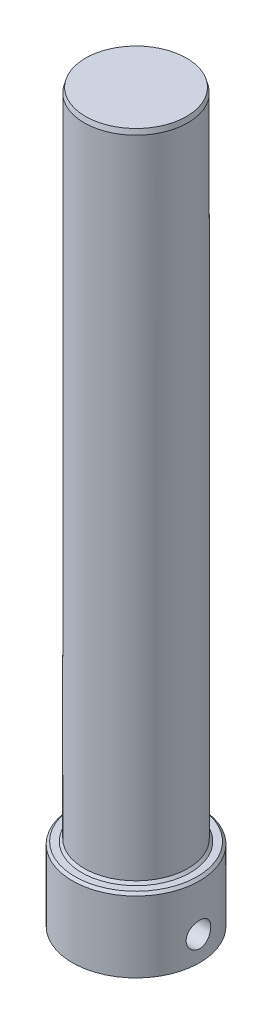
ISO-10303-21;
HEADER;
FILE_DESCRIPTION(('STEP AP214'),'2;1');
FILE_NAME('part.step','',(''),(''),'','','');
FILE_SCHEMA(('AUTOMOTIVE_DESIGN { 1 0 10303 214 1 1 1 1 }'));
ENDSEC;
DATA;
#1=APPLICATION_CONTEXT('core data for automotive mechanical design processes');
#2=APPLICATION_PROTOCOL_DEFINITION('international standard','automotive_design',2000,#1);
#3=PRODUCT_CONTEXT('',#1,'mechanical');
#4=PRODUCT('Part','Part','',(#3));
#5=PRODUCT_RELATED_PRODUCT_CATEGORY('part','',(#4));
#6=PRODUCT_DEFINITION_FORMATION('','',#4);
#7=PRODUCT_DEFINITION_CONTEXT('part definition',#1,'design');
#8=PRODUCT_DEFINITION('design','',#6,#7);
#9=PRODUCT_DEFINITION_SHAPE('','',#8);
#10=(LENGTH_UNIT() NAMED_UNIT(*) SI_UNIT(.MILLI.,.METRE.));
#11=(NAMED_UNIT(*) PLANE_ANGLE_UNIT() SI_UNIT($,.RADIAN.));
#12=(NAMED_UNIT(*) SI_UNIT($,.STERADIAN.) SOLID_ANGLE_UNIT());
#13=UNCERTAINTY_MEASURE_WITH_UNIT(LENGTH_MEASURE(1.E-05),#10,'distance_accuracy_value','');
#14=(GEOMETRIC_REPRESENTATION_CONTEXT(3) GLOBAL_UNCERTAINTY_ASSIGNED_CONTEXT((#13)) GLOBAL_UNIT_ASSIGNED_CONTEXT((#10,
#11,#12)) REPRESENTATION_CONTEXT('',''));
#15=CARTESIAN_POINT('',(0.,0.,0.));
#16=DIRECTION('',(0.,0.,1.));
#17=DIRECTION('',(1.,0.,0.));
#18=AXIS2_PLACEMENT_3D('',#15,#16,#17);
#19=CARTESIAN_POINT('',(0.,-19.05,0.));
#20=DIRECTION('',(0.,1.,0.));
#21=DIRECTION('',(0.,0.,1.));
#22=AXIS2_PLACEMENT_3D('',#19,#20,#21);
#23=CYLINDRICAL_SURFACE('',#22,16.51);
#24=CARTESIAN_POINT('',(0.,-0.63499999999992,0.));
#25=DIRECTION('',(0.,-1.,0.));
#26=DIRECTION('',(0.,0.,-1.));
#27=AXIS2_PLACEMENT_3D('',#24,#25,#26);
#28=CIRCLE('',#27,16.51);
#29=CARTESIAN_POINT('',(0.,-0.63499999999992,-16.51));
#30=VERTEX_POINT('',#29);
#31=EDGE_CURVE('E163',#30,#30,#28,.T.);
#32=ORIENTED_EDGE('',*,*,#31,.T.);
#33=EDGE_LOOP('',(#32));
#34=FACE_BOUND('',#33,.T.);
#35=CARTESIAN_POINT('',(16.51,-9.47460000000001,0.));
#36=CARTESIAN_POINT('',(16.50999674304,-9.47460667765774,0.17798180768145));
#37=CARTESIAN_POINT('',(16.507092342162,-9.4894971517823,0.356049251389576));
#38=CARTESIAN_POINT('',(16.4957861563419,-9.54862279771489,0.70715860012845));
#39=CARTESIAN_POINT('',(16.4873798679605,-9.59288200901663,0.880196266869084));
#40=CARTESIAN_POINT('',(16.4660094238541,-9.70933273581575,1.21611816234647));
#41=CARTESIAN_POINT('',(16.4530495104819,-9.78149825886547,1.3790116760923));
#42=CARTESIAN_POINT('',(16.4239838486872,-9.95163756771118,1.69036570315343));
#43=CARTESIAN_POINT('',(16.4078783211392,-10.0496095416334,1.83882722873875));
#44=CARTESIAN_POINT('',(16.3740667579311,-10.269906920626,2.11901057407795));
#45=CARTESIAN_POINT('',(16.3563445317891,-10.3924978998598,2.25052165052108));
#46=CARTESIAN_POINT('',(16.3214159486626,-10.6579822857242,2.49124700746998));
#47=CARTESIAN_POINT('',(16.3042096304062,-10.8008772119302,2.60045961763571));
#48=CARTESIAN_POINT('',(16.2721032999058,-11.104415875147,2.79437468505035));
#49=CARTESIAN_POINT('',(16.2572241415051,-11.2652001946592,2.87886084349837));
#50=CARTESIAN_POINT('',(16.2316858498261,-11.599017629918,3.01953958524562));
#51=CARTESIAN_POINT('',(16.2210263262906,-11.7720496111815,3.07573478519324));
#52=CARTESIAN_POINT('',(16.2052976051904,-12.1231893988036,3.15755616933753));
#53=CARTESIAN_POINT('',(16.2001610491341,-12.3012082260996,3.18355100189486));
#54=CARTESIAN_POINT('',(16.195856931735,-12.6591489223222,3.20537841463388));
#55=CARTESIAN_POINT('',(16.1966887977118,-12.8390706070123,3.20121388865741));
#56=CARTESIAN_POINT('',(16.2041662705445,-13.1930257783789,3.16313929064411));
#57=CARTESIAN_POINT('',(16.2107296102793,-13.367106536188,3.12965011355796));
#58=CARTESIAN_POINT('',(16.2288011307392,-13.707131058569,3.03454045432905));
#59=CARTESIAN_POINT('',(16.2403095346437,-13.8730744555108,2.97291870250598));
#60=CARTESIAN_POINT('',(16.2670595298424,-14.1933359669825,2.82288636306409));
#61=CARTESIAN_POINT('',(16.2823244679993,-14.3475731668967,2.73430738856974));
#62=CARTESIAN_POINT('',(16.3148523463308,-14.6391529563783,2.53299398365409));
#63=CARTESIAN_POINT('',(16.3321155026422,-14.776493715027,2.42025693905809));
#64=CARTESIAN_POINT('',(16.3670521266041,-15.0328122718534,2.17156617881324));
#65=CARTESIAN_POINT('',(16.3847276028201,-15.1514411539186,2.03525284352528));
#66=CARTESIAN_POINT('',(16.4182300950425,-15.3642024999627,1.74447813646845));
#67=CARTESIAN_POINT('',(16.4340570900122,-15.4583346851709,1.59001655820277));
#68=CARTESIAN_POINT('',(16.4621146941261,-15.6194885297334,1.26695419915434));
#69=CARTESIAN_POINT('',(16.4743402442977,-15.6864721023976,1.09833395254379));
#70=CARTESIAN_POINT('',(16.4937787411311,-15.7910649286274,0.751944560381681));
#71=CARTESIAN_POINT('',(16.5009922575615,-15.8286775211488,0.574176457227819));
#72=CARTESIAN_POINT('',(16.5095151126487,-15.8729708857586,0.217537640147078));
#73=CARTESIAN_POINT('',(16.5109156402885,-15.880129438696,0.0387283752846515));
#74=CARTESIAN_POINT('',(16.5079073053387,-15.8645956808591,-0.317531685249361));
#75=CARTESIAN_POINT('',(16.5034987486826,-15.8419049420877,-0.494982551965513));
#76=CARTESIAN_POINT('',(16.4894245188852,-15.7677137984373,-0.841960229706106));
#77=CARTESIAN_POINT('',(16.4798032895861,-15.7164568479512,-1.01154105682331));
#78=CARTESIAN_POINT('',(16.4563783011238,-15.5868530220226,-1.33970164288561));
#79=CARTESIAN_POINT('',(16.4425742430368,-15.5085042104173,-1.49828061459286));
#80=CARTESIAN_POINT('',(16.4120874585302,-15.3258951742523,-1.80196304563636));
#81=CARTESIAN_POINT('',(16.3953732217461,-15.2213451526579,-1.94688901633144));
#82=CARTESIAN_POINT('',(16.3609977215536,-14.9896915680213,-2.21731110390962));
#83=CARTESIAN_POINT('',(16.3433363633095,-14.8625857435063,-2.34280527017124));
#84=CARTESIAN_POINT('',(16.3087522057841,-14.5872595216095,-2.57263120454265));
#85=CARTESIAN_POINT('',(16.2918435170704,-14.4387640556155,-2.67663593044607));
#86=CARTESIAN_POINT('',(16.2609705055352,-14.1261296290826,-2.85822623915068));
#87=CARTESIAN_POINT('',(16.2470060688858,-13.9619912736709,-2.93581284337597));
#88=CARTESIAN_POINT('',(16.2237150163488,-13.6235331612705,-3.06190939284739));
#89=CARTESIAN_POINT('',(16.214365203049,-13.4492693554404,-3.11056503053249));
#90=CARTESIAN_POINT('',(16.2013109097146,-13.0948405207693,-3.17786420463009));
#91=CARTESIAN_POINT('',(16.1976057435017,-12.9146762119295,-3.1965113889653));
#92=CARTESIAN_POINT('',(16.1962967155522,-12.5568402333229,-3.20313576197228));
#93=CARTESIAN_POINT('',(16.1985901396438,-12.3791782943722,-3.19162926715146));
#94=CARTESIAN_POINT('',(16.208791254997,-12.028373074834,-3.13940786892188));
#95=CARTESIAN_POINT('',(16.2166989070867,-11.8552297627276,-3.09869316930592));
#96=CARTESIAN_POINT('',(16.237192887046,-11.5186798504674,-2.98943524126549));
#97=CARTESIAN_POINT('',(16.2497691865703,-11.3552532453062,-2.92095163211065));
#98=CARTESIAN_POINT('',(16.2781898190479,-11.0421279714725,-2.75815771372782));
#99=CARTESIAN_POINT('',(16.2940344046183,-10.8924303652541,-2.66384540792653));
#100=CARTESIAN_POINT('',(16.3275228883509,-10.6084337733996,-2.45029202500991));
#101=CARTESIAN_POINT('',(16.3451914963496,-10.4744191298477,-2.33067662058621));
#102=CARTESIAN_POINT('',(16.3801561480506,-10.2281924525785,-2.07068925117976));
#103=CARTESIAN_POINT('',(16.3974521052458,-10.1159854338071,-1.93031252490078));
#104=CARTESIAN_POINT('',(16.4299205179773,-9.91553400946462,-1.63114902096518));
#105=CARTESIAN_POINT('',(16.4450706857495,-9.82753326228692,-1.47219647581962));
#106=CARTESIAN_POINT('',(16.4713220692793,-9.67962902624368,-1.14151510073308));
#107=CARTESIAN_POINT('',(16.4824270095001,-9.61969967727725,-0.969798199328333));
#108=CARTESIAN_POINT('',(16.4971258601764,-9.54152763285113,-0.664695879519594));
#109=CARTESIAN_POINT('',(16.5019259058909,-9.51647358438861,-0.533071267119778));
#110=CARTESIAN_POINT('',(16.5083641553618,-9.48300749448238,-0.267647205535638));
#111=CARTESIAN_POINT('',(16.5100024493346,-9.47459497819507,-0.133847818515401));
#112=CARTESIAN_POINT('',(16.51,-9.47460000000001,0.));
#113=B_SPLINE_CURVE_WITH_KNOTS('',3,(#35,#36,#37,#38,#39,#40,#41,#42,#43,#44,#45,#46,#47,#48,
#49,#50,#51,#52,#53,#54,#55,#56,#57,#58,#59,#60,#61,#62,#63,#64,#65,#66,#67,#68,#69,#70,#71,#72,
#73,#74,#75,#76,#77,#78,#79,#80,#81,#82,#83,#84,#85,#86,#87,#88,#89,#90,#91,#92,#93,#94,#95,#96,
#97,#98,#99,#100,#101,#102,#103,#104,#105,#106,#107,#108,#109,#110,#111,#112),.UNSPECIFIED.,.T.,
.F.,(4,2,2,2,2,2,2,2,2,2,2,2,2,2,2,2,2,2,2,2,2,2,2,2,2,2,2,2,2,2,2,2,2,2,2,2,2,2,4),(0.,
0.533455850880798,1.0673488963789,1.60074585728947,2.1341053783184,2.6735615359542,
3.21305808851611,3.75714183271645,4.30117524502292,4.83849558583837,5.37576437053482,
5.90544588478012,6.43515130699299,6.96823589084945,7.50137818960588,8.04351567034775,
8.58565932030948,9.12856093071924,9.67140081392448,10.2056921560157,10.7399553609571,
11.2697334611978,11.7995494306993,12.3355061477134,12.8715166308032,13.4151651522043,
13.9587926517185,14.4996588071386,15.0404592081862,15.5720603196624,16.1036577220635,
16.6341197886237,17.1646228717903,17.703604584557,18.2427100968776,18.7870586150841,
19.3309046742396,19.7320914038779,20.1332666860308),.UNSPECIFIED.);
#114=CARTESIAN_POINT('',(16.51,-9.47460000000001,0.));
#115=VERTEX_POINT('',#114);
#116=EDGE_CURVE('E98',#115,#115,#113,.T.);
#117=ORIENTED_EDGE('',*,*,#116,.F.);
#118=EDGE_LOOP('',(#117));
#119=FACE_BOUND('',#118,.T.);
#120=CARTESIAN_POINT('',(-16.1968373406662,-12.675,3.20039999999999));
#121=CARTESIAN_POINT('',(-16.1968408370885,-12.4970536068067,3.20039329462291));
#122=CARTESIAN_POINT('',(-16.199801714413,-12.3190215017697,3.18550854520744));
#123=CARTESIAN_POINT('',(-16.2113092396805,-11.9679855332422,3.12640769828341));
#124=CARTESIAN_POINT('',(-16.21986049139,-11.7949859368602,3.08216742556175));
#125=CARTESIAN_POINT('',(-16.2415447141987,-11.4591446598796,2.96577206860551));
#126=CARTESIAN_POINT('',(-16.2546732717614,-11.2962933717222,2.89364386723661));
#127=CARTESIAN_POINT('',(-16.2840276129419,-10.9850105054433,2.72359253019602));
#128=CARTESIAN_POINT('',(-16.3002531893747,-10.8365779637349,2.62567111987785));
#129=CARTESIAN_POINT('',(-16.3342142860278,-10.5563635938619,2.40542553248826));
#130=CARTESIAN_POINT('',(-16.3519654972302,-10.4248012944443,2.28282442927953));
#131=CARTESIAN_POINT('',(-16.3868394064612,-10.1839765897216,2.01729806766049));
#132=CARTESIAN_POINT('',(-16.4039620617819,-10.0747156974195,1.87437143141261));
#133=CARTESIAN_POINT('',(-16.4358182666265,-9.88074875564761,1.57080329941635));
#134=CARTESIAN_POINT('',(-16.4505311646598,-9.79625050942602,1.41002667352363));
#135=CARTESIAN_POINT('',(-16.4757341598397,-9.65554731981939,1.07622588690727));
#136=CARTESIAN_POINT('',(-16.4862246281403,-9.59933988954563,0.903202804227378));
#137=CARTESIAN_POINT('',(-16.5016899316472,-9.51749497684877,0.552097205795982));
#138=CARTESIAN_POINT('',(-16.5067315424367,-9.49148709868731,0.374104021698516));
#139=CARTESIAN_POINT('',(-16.510961469133,-9.46962470032813,0.0162140490808797));
#140=CARTESIAN_POINT('',(-16.5101503162826,-9.47376744342292,-0.163682565188923));
#141=CARTESIAN_POINT('',(-16.5028180736043,-9.51180619047498,-0.517730132558862));
#142=CARTESIAN_POINT('',(-16.4963735392609,-9.54530329521185,-0.691925758559918));
#143=CARTESIAN_POINT('',(-16.4785847412376,-9.64046810456808,-1.03217586389311));
#144=CARTESIAN_POINT('',(-16.4672402900899,-9.70213688702405,-1.19823003146726));
#145=CARTESIAN_POINT('',(-16.4407992608138,-9.85226930171679,-1.51863105430753));
#146=CARTESIAN_POINT('',(-16.4256806729946,-9.9408908008448,-1.67290204628717));
#147=CARTESIAN_POINT('',(-16.3933606898227,-10.1422964437526,-1.96453167009857));
#148=CARTESIAN_POINT('',(-16.3761590687752,-10.2550832068382,-2.10188846603414));
#149=CARTESIAN_POINT('',(-16.3412431595578,-10.5038110368456,-2.35815602648105));
#150=CARTESIAN_POINT('',(-16.3235250892839,-10.6401011532109,-2.47672774070443));
#151=CARTESIAN_POINT('',(-16.2898415529933,-10.9308084319086,-2.68938455735478));
#152=CARTESIAN_POINT('',(-16.2738761162447,-11.0852258968695,-2.78346925089668));
#153=CARTESIAN_POINT('',(-16.2454990234452,-11.4082727356134,-2.94458807043301));
#154=CARTESIAN_POINT('',(-16.2330942220224,-11.5769287234587,-3.0115701209198));
#155=CARTESIAN_POINT('',(-16.2133455966866,-11.9233963098618,-3.11614912524959));
#156=CARTESIAN_POINT('',(-16.2060011565122,-12.1012067907304,-3.15374965731124));
#157=CARTESIAN_POINT('',(-16.1973275168186,-12.457870811803,-3.19799741128217));
#158=CARTESIAN_POINT('',(-16.1959034219589,-12.6366615226937,-3.20513299684504));
#159=CARTESIAN_POINT('',(-16.1989773838334,-12.9928791052729,-3.18955993383087));
#160=CARTESIAN_POINT('',(-16.2034751263229,-13.1703060488277,-3.16685286886616));
#161=CARTESIAN_POINT('',(-16.217797349929,-13.5171361018236,-3.09265921637369));
#162=CARTESIAN_POINT('',(-16.2275739667984,-13.6865966593357,-3.04143110502172));
#163=CARTESIAN_POINT('',(-16.2513107569838,-14.0145293488346,-2.91192485062961));
#164=CARTESIAN_POINT('',(-16.2652712569361,-14.173000621697,-2.833644595553));
#165=CARTESIAN_POINT('',(-16.2960174609597,-14.4766005379119,-2.65114140980347));
#166=CARTESIAN_POINT('',(-16.3128357814171,-14.6215412414279,-2.5466114356931));
#167=CARTESIAN_POINT('',(-16.3473120131875,-14.8920022733975,-2.31498768818158));
#168=CARTESIAN_POINT('',(-16.3649700053153,-15.0175207275762,-2.18789173966978));
#169=CARTESIAN_POINT('',(-16.3994424353559,-15.2474123103623,-1.91255704681583));
#170=CARTESIAN_POINT('',(-16.4162411296968,-15.3514561126571,-1.76404104429389));
#171=CARTESIAN_POINT('',(-16.4468329153043,-15.5331149019244,-1.45135384979494));
#172=CARTESIAN_POINT('',(-16.4606261276923,-15.6107309540107,-1.2871832890827));
#173=CARTESIAN_POINT('',(-16.4835853625841,-15.7368444919255,-0.948734966197626));
#174=CARTESIAN_POINT('',(-16.4927764959996,-15.7855002784596,-0.774517969108592));
#175=CARTESIAN_POINT('',(-16.5056033954493,-15.8528155607709,-0.420188918760878));
#176=CARTESIAN_POINT('',(-16.5092397881807,-15.8714784404217,-0.24007753286152));
#177=CARTESIAN_POINT('',(-16.5105338429712,-15.8781536941807,0.117775704217827));
#178=CARTESIAN_POINT('',(-16.5082883058813,-15.866662321135,0.295508137030864));
#179=CARTESIAN_POINT('',(-16.4982731492246,-15.8144465650402,0.646458375864037));
#180=CARTESIAN_POINT('',(-16.4905035906677,-15.7737225048509,0.819676231723427));
#181=CARTESIAN_POINT('',(-16.4703147317054,-15.6644122848564,1.15639449812764));
#182=CARTESIAN_POINT('',(-16.45790482037,-15.5958823624448,1.31991376346508));
#183=CARTESIAN_POINT('',(-16.4297750496249,-15.4329668042514,1.63320539817821));
#184=CARTESIAN_POINT('',(-16.4140549483119,-15.338579278686,1.78297676173029));
#185=CARTESIAN_POINT('',(-16.3807343282353,-15.1249367322104,2.06698451812295));
#186=CARTESIAN_POINT('',(-16.3631088199613,-15.0053249186914,2.20094961538694));
#187=CARTESIAN_POINT('',(-16.3281169042677,-14.7453659332463,2.44707799498908));
#188=CARTESIAN_POINT('',(-16.3107505589572,-14.6050138760175,2.55923612630815));
#189=CARTESIAN_POINT('',(-16.2780526864317,-14.3058763617694,2.75962697300912));
#190=CARTESIAN_POINT('',(-16.2627432511022,-14.146920559583,2.84760914075398));
#191=CARTESIAN_POINT('',(-16.2361603490368,-13.8162338622295,2.9954777742769));
#192=CARTESIAN_POINT('',(-16.2248831489107,-13.6445149631382,3.05539024543079));
#193=CARTESIAN_POINT('',(-16.209942995461,-13.3394560885758,3.13352096460904));
#194=CARTESIAN_POINT('',(-16.2050581936248,-13.2078796069866,3.15855668056737));
#195=CARTESIAN_POINT('',(-16.198504101096,-12.9425515253264,3.19199846386678));
#196=CARTESIAN_POINT('',(-16.1968347116651,-12.8087999921736,3.20040504185212));
#197=CARTESIAN_POINT('',(-16.1968373406662,-12.675,3.20039999999999));
#198=B_SPLINE_CURVE_WITH_KNOTS('',3,(#120,#121,#122,#123,#124,#125,#126,#127,#128,#129,#130,
#131,#132,#133,#134,#135,#136,#137,#138,#139,#140,#141,#142,#143,#144,#145,#146,#147,#148,#149,
#150,#151,#152,#153,#154,#155,#156,#157,#158,#159,#160,#161,#162,#163,#164,#165,#166,#167,#168,
#169,#170,#171,#172,#173,#174,#175,#176,#177,#178,#179,#180,#181,#182,#183,#184,#185,#186,#187,
#188,#189,#190,#191,#192,#193,#194,#195,#196,#197),.UNSPECIFIED.,.T.,.F.,(4,2,2,2,2,2,2,2,2,2,2,
2,2,2,2,2,2,2,2,2,2,2,2,2,2,2,2,2,2,2,2,2,2,2,2,2,2,2,4),(0.,0.533349407210311,1.06713859076651,
1.60041450027685,2.13365474707011,2.67325021383514,3.21288227642379,3.75692102558969,
4.30091194297104,4.8381579166777,5.37535512632323,5.90536357712515,6.43539230752734,
6.96858733469458,7.5018401848584,8.04382889867185,8.5858266620499,9.12886094014704,
9.67182907468013,10.2060597707925,10.7402621188811,11.2697001853053,11.7991795957807,
12.33516700758,12.8712061107201,13.4149383240578,13.9586486208422,14.499358960155,
15.0400082909156,15.571816095792,16.1036180272185,16.6343497076525,17.165120186566,
17.703973192481,18.2429533265351,18.7873248615241,19.331191057323,19.7322350835932,
20.1332667944918),.UNSPECIFIED.);
#199=CARTESIAN_POINT('',(-16.1968373406662,-12.675,3.20039999999999));
#200=VERTEX_POINT('',#199);
#201=EDGE_CURVE('E121',#200,#200,#198,.T.);
#202=ORIENTED_EDGE('',*,*,#201,.F.);
#203=EDGE_LOOP('',(#202));
#204=FACE_BOUND('',#203,.T.);
#205=CARTESIAN_POINT('',(0.,-19.05,0.));
#206=DIRECTION('',(0.,1.,0.));
#207=DIRECTION('',(0.,0.,-1.));
#208=AXIS2_PLACEMENT_3D('',#205,#206,#207);
#209=CIRCLE('',#208,16.51);
#210=CARTESIAN_POINT('',(0.,-19.05,-16.51));
#211=VERTEX_POINT('',#210);
#212=EDGE_CURVE('E107',#211,#211,#209,.T.);
#213=ORIENTED_EDGE('',*,*,#212,.T.);
#214=EDGE_LOOP('',(#213));
#215=FACE_BOUND('',#214,.T.);
#216=ADVANCED_FACE('F44',(#34,#119,#204,#215),#23,.T.);
#217=CARTESIAN_POINT('',(0.,-19.05,0.));
#218=DIRECTION('',(0.,-1.,0.));
#219=DIRECTION('',(0.,0.,-1.));
#220=AXIS2_PLACEMENT_3D('',#217,#218,#219);
#221=PLANE('',#220);
#222=CARTESIAN_POINT('',(0.,-19.05,0.));
#223=DIRECTION('',(0.,-1.,0.));
#224=DIRECTION('',(0.,0.,-1.));
#225=AXIS2_PLACEMENT_3D('',#222,#223,#224);
#226=CIRCLE('',#225,11.47);
#227=CARTESIAN_POINT('',(0.,-19.05,-11.47));
#228=VERTEX_POINT('',#227);
#229=EDGE_CURVE('E168',#228,#228,#226,.F.);
#230=ORIENTED_EDGE('',*,*,#229,.T.);
#231=EDGE_LOOP('',(#230));
#232=FACE_BOUND('',#231,.T.);
#233=ORIENTED_EDGE('',*,*,#212,.F.);
#234=EDGE_LOOP('',(#233));
#235=FACE_BOUND('',#234,.T.);
#236=ADVANCED_FACE('F114',(#232,#235),#221,.T.);
#237=CARTESIAN_POINT('',(0.,0.,0.));
#238=DIRECTION('',(0.,-1.,0.));
#239=DIRECTION('',(0.,0.,-1.));
#240=AXIS2_PLACEMENT_3D('',#237,#238,#239);
#241=PLANE('',#240);
#242=CARTESIAN_POINT('',(0.,0.,0.));
#243=DIRECTION('',(0.,-1.,0.));
#244=DIRECTION('',(0.,0.,-1.));
#245=AXIS2_PLACEMENT_3D('',#242,#243,#244);
#246=CIRCLE('',#245,14.0970000000002);
#247=CARTESIAN_POINT('',(0.,0.,-14.0970000000002));
#248=VERTEX_POINT('',#247);
#249=EDGE_CURVE('E156',#248,#248,#246,.T.);
#250=ORIENTED_EDGE('',*,*,#249,.T.);
#251=EDGE_LOOP('',(#250));
#252=FACE_BOUND('',#251,.T.);
#253=CARTESIAN_POINT('',(0.,0.,0.));
#254=DIRECTION('',(0.,-1.,0.));
#255=DIRECTION('',(0.,0.,-1.));
#256=AXIS2_PLACEMENT_3D('',#253,#254,#255);
#257=CIRCLE('',#256,15.8750000000001);
#258=CARTESIAN_POINT('',(0.,0.,-15.8750000000001));
#259=VERTEX_POINT('',#258);
#260=EDGE_CURVE('E166',#259,#259,#257,.F.);
#261=ORIENTED_EDGE('',*,*,#260,.T.);
#262=EDGE_LOOP('',(#261));
#263=FACE_BOUND('',#262,.T.);
#264=ADVANCED_FACE('F116',(#252,#263),#241,.F.);
#265=CARTESIAN_POINT('',(0.,169.545,0.));
#266=DIRECTION('',(0.,-1.,0.));
#267=DIRECTION('',(0.,0.,-1.));
#268=AXIS2_PLACEMENT_3D('',#265,#266,#267);
#269=CYLINDRICAL_SURFACE('',#268,13.462);
#270=CARTESIAN_POINT('',(0.,168.274999999999,0.));
#271=DIRECTION('',(0.,1.,0.));
#272=DIRECTION('',(0.,0.,1.));
#273=AXIS2_PLACEMENT_3D('',#270,#271,#272);
#274=CIRCLE('',#273,13.462);
#275=CARTESIAN_POINT('',(0.,168.274999999999,13.462));
#276=VERTEX_POINT('',#275);
#277=EDGE_CURVE('E11',#276,#276,#274,.F.);
#278=ORIENTED_EDGE('',*,*,#277,.T.);
#279=EDGE_LOOP('',(#278));
#280=FACE_BOUND('',#279,.T.);
#281=CARTESIAN_POINT('',(0.,0.635000000000163,0.));
#282=DIRECTION('',(0.,-1.,0.));
#283=DIRECTION('',(0.,0.,-1.));
#284=AXIS2_PLACEMENT_3D('',#281,#282,#283);
#285=CIRCLE('',#284,13.462);
#286=CARTESIAN_POINT('',(0.,0.635000000000163,-13.462));
#287=VERTEX_POINT('',#286);
#288=EDGE_CURVE('E158',#287,#287,#285,.F.);
#289=ORIENTED_EDGE('',*,*,#288,.T.);
#290=EDGE_LOOP('',(#289));
#291=FACE_BOUND('',#290,.T.);
#292=ADVANCED_FACE('F139',(#280,#291),#269,.T.);
#293=CARTESIAN_POINT('',(0.,169.545,0.));
#294=DIRECTION('',(0.,1.,0.));
#295=DIRECTION('',(0.,0.,1.));
#296=AXIS2_PLACEMENT_3D('',#293,#294,#295);
#297=PLANE('',#296);
#298=CARTESIAN_POINT('',(0.,169.545,0.));
#299=DIRECTION('',(0.,1.,0.));
#300=DIRECTION('',(0.,0.,1.));
#301=AXIS2_PLACEMENT_3D('',#298,#299,#300);
#302=CIRCLE('',#301,13.1217045256123);
#303=CARTESIAN_POINT('',(0.,169.545,13.1217045256123));
#304=VERTEX_POINT('',#303);
#305=EDGE_CURVE('E52',#304,#304,#302,.T.);
#306=ORIENTED_EDGE('',*,*,#305,.T.);
#307=EDGE_LOOP('',(#306));
#308=FACE_BOUND('',#307,.T.);
#309=ADVANCED_FACE('F144',(#308),#297,.T.);
#310=CARTESIAN_POINT('',(0.,-3.175,0.));
#311=DIRECTION('',(0.,-1.,0.));
#312=DIRECTION('',(0.,0.,-1.));
#313=AXIS2_PLACEMENT_3D('',#310,#311,#312);
#314=CYLINDRICAL_SURFACE('',#313,10.2);
#315=CARTESIAN_POINT('',(0.,-17.78,0.));
#316=DIRECTION('',(0.,-1.,0.));
#317=DIRECTION('',(0.,0.,-1.));
#318=AXIS2_PLACEMENT_3D('',#315,#316,#317);
#319=CIRCLE('',#318,10.2);
#320=CARTESIAN_POINT('',(0.,-17.78,-10.2));
#321=VERTEX_POINT('',#320);
#322=EDGE_CURVE('E106',#321,#321,#319,.T.);
#323=ORIENTED_EDGE('',*,*,#322,.T.);
#324=EDGE_LOOP('',(#323));
#325=FACE_BOUND('',#324,.T.);
#326=CARTESIAN_POINT('',(9.68490783848767,-12.675,3.2004));
#327=CARTESIAN_POINT('',(9.68490883266821,-12.849950913271,3.20039892586468));
#328=CARTESIAN_POINT('',(9.68970024615615,-13.0249128561156,3.18600568228919));
#329=CARTESIAN_POINT('',(9.70826260883219,-13.3696940483548,3.12897943755107));
#330=CARTESIAN_POINT('',(9.72203592662601,-13.5395119288509,3.08633898730914));
#331=CARTESIAN_POINT('',(9.75685185054427,-13.8689607127044,2.97443085529272));
#332=CARTESIAN_POINT('',(9.77788150623465,-14.0286091682213,2.90521058602798));
#333=CARTESIAN_POINT('',(9.82482255268545,-14.334071875493,2.74226615801979));
#334=CARTESIAN_POINT('',(9.85073481885756,-14.4798836393837,2.64853760397351));
#335=CARTESIAN_POINT('',(9.90552794558571,-14.7585837435566,2.43576090122778));
#336=CARTESIAN_POINT('',(9.93447647898375,-14.8909224013379,2.31601002211239));
#337=CARTESIAN_POINT('',(9.99150477305061,-15.1340074915928,2.05609143344929));
#338=CARTESIAN_POINT('',(10.019584410916,-15.2447508835673,1.91592085376246));
#339=CARTESIAN_POINT('',(10.0724857455209,-15.4439315010366,1.61518760890245));
#340=CARTESIAN_POINT('',(10.0972184778289,-15.531802055986,1.45423260383434));
#341=CARTESIAN_POINT('',(10.1398486180422,-15.6790106232874,1.11892020713111));
#342=CARTESIAN_POINT('',(10.1577476461163,-15.7383553995392,0.944566004035442));
#343=CARTESIAN_POINT('',(10.1842146221586,-15.8249907885733,0.59316040148627));
#344=CARTESIAN_POINT('',(10.1930554955903,-15.8532210284559,0.41636158952249));
#345=CARTESIAN_POINT('',(10.2013742493619,-15.8798037447998,0.0603305452354245));
#346=CARTESIAN_POINT('',(10.2008542748369,-15.87816306649,-0.118901120167261));
#347=CARTESIAN_POINT('',(10.1906996569874,-15.8456673362163,-0.468094715964739));
#348=CARTESIAN_POINT('',(10.1813828548558,-15.8158309987162,-0.63816216906313));
#349=CARTESIAN_POINT('',(10.1550728222334,-15.7294631946049,-0.970741339298227));
#350=CARTESIAN_POINT('',(10.138079089756,-15.672929982302,-1.13325256157432));
#351=CARTESIAN_POINT('',(10.0978992581119,-15.5341222267642,-1.44844933307421));
#352=CARTESIAN_POINT('',(10.0746395797722,-15.4515396853535,-1.60098947839175));
#353=CARTESIAN_POINT('',(10.0243767899007,-15.2632249560292,-1.89036283711826));
#354=CARTESIAN_POINT('',(9.99737272653199,-15.1574868779177,-2.0271920405268));
#355=CARTESIAN_POINT('',(9.94115541542306,-14.9206380655086,-2.28733308393958));
#356=CARTESIAN_POINT('',(9.91189701686771,-14.7886482684628,-2.40983592933876));
#357=CARTESIAN_POINT('',(9.85544600476605,-14.5057263037764,-2.6312105765544));
#358=CARTESIAN_POINT('',(9.82825363893567,-14.3547918704223,-2.73007954772578));
#359=CARTESIAN_POINT('',(9.77878458453371,-14.0359630661853,-2.90233147465284));
#360=CARTESIAN_POINT('',(9.75656720380155,-13.8678956146216,-2.97541236787446));
#361=CARTESIAN_POINT('',(9.72025877566158,-13.5209743975196,-3.09197996599612));
#362=CARTESIAN_POINT('',(9.70616478069803,-13.3421245703991,-3.13547740623075));
#363=CARTESIAN_POINT('',(9.68835391826993,-12.9864714125791,-3.19007754026352));
#364=CARTESIAN_POINT('',(9.68424018022604,-12.8098781729432,-3.20241998238934));
#365=CARTESIAN_POINT('',(9.6857532851716,-12.4571308992551,-3.19784197702619));
#366=CARTESIAN_POINT('',(9.69137860808314,-12.2809768009589,-3.1809260961925));
#367=CARTESIAN_POINT('',(9.71134394884377,-11.9394631951509,-3.11941994648697));
#368=CARTESIAN_POINT('',(9.72542446020728,-11.7739386682264,-3.07565295680354));
#369=CARTESIAN_POINT('',(9.76043808659058,-11.4526019354729,-2.96265482239493));
#370=CARTESIAN_POINT('',(9.78137232516689,-11.2967913270708,-2.89341950232329));
#371=CARTESIAN_POINT('',(9.82848467296632,-10.9943278319071,-2.72917000927186));
#372=CARTESIAN_POINT('',(9.8547967005353,-10.8480690851642,-2.63346943637196));
#373=CARTESIAN_POINT('',(9.90942369601518,-10.5732353882399,-2.41980594767883));
#374=CARTESIAN_POINT('',(9.93773918721453,-10.4446650841479,-2.30183720210025));
#375=CARTESIAN_POINT('',(9.99461590132767,-10.2033092843355,-2.04111659242063));
#376=CARTESIAN_POINT('',(10.0231378563021,-10.0914090566159,-1.89753445282693));
#377=CARTESIAN_POINT('',(10.0760310135439,-9.89325498997841,-1.59293983414125));
#378=CARTESIAN_POINT('',(10.1004024039183,-9.80699998866542,-1.43192814551214));
#379=CARTESIAN_POINT('',(10.1421104800492,-9.66341087003535,-1.09802721588051));
#380=CARTESIAN_POINT('',(10.1594976857838,-9.60586829926043,-0.92523425378959));
#381=CARTESIAN_POINT('',(10.185500364737,-9.52085392331277,-0.57178089648708));
#382=CARTESIAN_POINT('',(10.1941186073653,-9.493372623998,-0.391123003981739));
#383=CARTESIAN_POINT('',(10.2014273082919,-9.47003713325183,-0.0352138788110924));
#384=CARTESIAN_POINT('',(10.2005190223519,-9.47290470043675,0.139946292273649));
#385=CARTESIAN_POINT('',(10.1898394190108,-9.5070907464516,0.487176210836792));
#386=CARTESIAN_POINT('',(10.1800686874711,-9.53840734462869,0.65924616183066));
#387=CARTESIAN_POINT('',(10.152890228301,-9.6277864090546,0.993262686054351));
#388=CARTESIAN_POINT('',(10.1355810348821,-9.68550426195751,1.15531004999122));
#389=CARTESIAN_POINT('',(10.0951104430856,-9.82573574063091,1.46749805152434));
#390=CARTESIAN_POINT('',(10.0719480371668,-9.90825363581297,1.61763663335382));
#391=CARTESIAN_POINT('',(10.0212030265858,-10.0989971981282,1.9073181004886));
#392=CARTESIAN_POINT('',(9.99349660086003,-10.2080037297842,2.04632490089666));
#393=CARTESIAN_POINT('',(9.93714176540555,-10.4472559883779,2.3044973586323));
#394=CARTESIAN_POINT('',(9.90849307480087,-10.5775080949829,2.42365703443227));
#395=CARTESIAN_POINT('',(9.85235783822189,-10.8607802466127,2.6427802504214));
#396=CARTESIAN_POINT('',(9.82494231192026,-11.0144165542307,2.74196755029838));
#397=CARTESIAN_POINT('',(9.77559952772404,-11.3370036075591,2.91300898510436));
#398=CARTESIAN_POINT('',(9.75367009563444,-11.5059482501452,2.98487395403865));
#399=CARTESIAN_POINT('',(9.71954049441793,-11.8399613708959,3.09411378927608));
#400=CARTESIAN_POINT('',(9.70668467383611,-12.0041909038692,3.13385327195047));
#401=CARTESIAN_POINT('',(9.6893689219321,-12.3372776491848,3.1869935833459));
#402=CARTESIAN_POINT('',(9.68490687888365,-12.5061336867315,3.20040103677807));
#403=CARTESIAN_POINT('',(9.68490783848767,-12.675,3.2004));
#404=B_SPLINE_CURVE_WITH_KNOTS('',3,(#326,#327,#328,#329,#330,#331,#332,#333,#334,#335,#336,
#337,#338,#339,#340,#341,#342,#343,#344,#345,#346,#347,#348,#349,#350,#351,#352,#353,#354,#355,
#356,#357,#358,#359,#360,#361,#362,#363,#364,#365,#366,#367,#368,#369,#370,#371,#372,#373,#374,
#375,#376,#377,#378,#379,#380,#381,#382,#383,#384,#385,#386,#387,#388,#389,#390,#391,#392,#393,
#394,#395,#396,#397,#398,#399,#400,#401,#402,#403),.UNSPECIFIED.,.T.,.F.,(4,2,2,2,2,2,2,2,2,2,2,
2,2,2,2,2,2,2,2,2,2,2,2,2,2,2,2,2,2,2,2,2,2,2,2,2,2,2,4),(0.,0.524228865141217,1.04859602989479,
1.57203215254227,2.09556221240756,2.63553401894942,3.17558179586117,3.72795294864645,
4.28019306106854,4.81525575132888,5.35019582800115,5.86651876187179,6.38287546244983,
6.90558192367131,7.42842150330282,7.97321822609836,8.51808016690813,9.06912746397433,
9.61997468845283,10.1485296226103,10.6770020670646,11.1900290316238,11.7031401407126,
12.231061716329,12.7591216934544,13.309270891324,13.859395149336,14.4054651577589,
14.9513626530386,15.474362617975,15.9973280119697,16.5136538386134,17.0300686034686,
17.5640977960413,18.0982876442775,18.6503619007428,19.2022170167134,19.7083411284512,
20.2143378912587),.UNSPECIFIED.);
#405=CARTESIAN_POINT('',(9.68490783848767,-12.675,3.2004));
#406=VERTEX_POINT('',#405);
#407=EDGE_CURVE('E64',#406,#406,#404,.T.);
#408=ORIENTED_EDGE('',*,*,#407,.T.);
#409=EDGE_LOOP('',(#408));
#410=FACE_BOUND('',#409,.T.);
#411=CARTESIAN_POINT('',(-9.68490783848767,-12.675,3.2004));
#412=CARTESIAN_POINT('',(-9.68490883266821,-12.500049086729,3.20039892586468));
#413=CARTESIAN_POINT('',(-9.68970024615615,-12.3250871438844,3.18600568228919));
#414=CARTESIAN_POINT('',(-9.70826260883219,-11.9803059516452,3.12897943755107));
#415=CARTESIAN_POINT('',(-9.72203592662601,-11.8104880711491,3.08633898730914));
#416=CARTESIAN_POINT('',(-9.75685185054427,-11.4810392872956,2.97443085529272));
#417=CARTESIAN_POINT('',(-9.77788150623464,-11.3213908317787,2.90521058602798));
#418=CARTESIAN_POINT('',(-9.82482255268545,-11.015928124507,2.74226615801979));
#419=CARTESIAN_POINT('',(-9.85073481885756,-10.8701163606163,2.64853760397351));
#420=CARTESIAN_POINT('',(-9.90552794558571,-10.5914162564434,2.43576090122778));
#421=CARTESIAN_POINT('',(-9.93447647898374,-10.4590775986621,2.31601002211239));
#422=CARTESIAN_POINT('',(-9.9915047730506,-10.2159925084072,2.05609143344929));
#423=CARTESIAN_POINT('',(-10.019584410916,-10.1052491164327,1.91592085376246));
#424=CARTESIAN_POINT('',(-10.0724857455209,-9.90606849896345,1.61518760890246));
#425=CARTESIAN_POINT('',(-10.0972184778289,-9.81819794401402,1.45423260383434));
#426=CARTESIAN_POINT('',(-10.1398486180422,-9.67098937671258,1.11892020713111));
#427=CARTESIAN_POINT('',(-10.1577476461163,-9.61164460046081,0.944566004035445));
#428=CARTESIAN_POINT('',(-10.1842146221586,-9.52500921142674,0.593160401486273));
#429=CARTESIAN_POINT('',(-10.1930554955903,-9.4967789715441,0.416361589522493));
#430=CARTESIAN_POINT('',(-10.2013742493619,-9.47019625520015,0.0603305452354263));
#431=CARTESIAN_POINT('',(-10.2008542748369,-9.47183693350999,-0.118901120167259));
#432=CARTESIAN_POINT('',(-10.1906996569874,-9.50433266378371,-0.468094715964738));
#433=CARTESIAN_POINT('',(-10.1813828548558,-9.53416900128385,-0.638162169063129));
#434=CARTESIAN_POINT('',(-10.1550728222334,-9.6205368053951,-0.970741339298225));
#435=CARTESIAN_POINT('',(-10.138079089756,-9.67707001769802,-1.13325256157432));
#436=CARTESIAN_POINT('',(-10.0978992581119,-9.8158777732358,-1.44844933307421));
#437=CARTESIAN_POINT('',(-10.0746395797722,-9.89846031464647,-1.60098947839175));
#438=CARTESIAN_POINT('',(-10.0243767899007,-10.0867750439708,-1.89036283711826));
#439=CARTESIAN_POINT('',(-9.99737272653199,-10.1925131220823,-2.0271920405268));
#440=CARTESIAN_POINT('',(-9.94115541542306,-10.4293619344914,-2.28733308393958));
#441=CARTESIAN_POINT('',(-9.91189701686771,-10.5613517315372,-2.40983592933876));
#442=CARTESIAN_POINT('',(-9.85544600476605,-10.8442736962236,-2.63121057655439));
#443=CARTESIAN_POINT('',(-9.82825363893567,-10.9952081295777,-2.73007954772578));
#444=CARTESIAN_POINT('',(-9.77878458453371,-11.3140369338147,-2.90233147465284));
#445=CARTESIAN_POINT('',(-9.75656720380155,-11.4821043853784,-2.97541236787446));
#446=CARTESIAN_POINT('',(-9.72025877566158,-11.8290256024804,-3.09197996599612));
#447=CARTESIAN_POINT('',(-9.70616478069803,-12.0078754296009,-3.13547740623075));
#448=CARTESIAN_POINT('',(-9.68835391826993,-12.3635285874209,-3.19007754026352));
#449=CARTESIAN_POINT('',(-9.68424018022604,-12.5401218270568,-3.20241998238934));
#450=CARTESIAN_POINT('',(-9.6857532851716,-12.8928691007449,-3.19784197702619));
#451=CARTESIAN_POINT('',(-9.69137860808314,-13.0690231990411,-3.1809260961925));
#452=CARTESIAN_POINT('',(-9.71134394884377,-13.4105368048491,-3.11941994648697));
#453=CARTESIAN_POINT('',(-9.72542446020727,-13.5760613317736,-3.07565295680354));
#454=CARTESIAN_POINT('',(-9.76043808659058,-13.8973980645271,-2.96265482239493));
#455=CARTESIAN_POINT('',(-9.78137232516689,-14.0532086729292,-2.89341950232329));
#456=CARTESIAN_POINT('',(-9.82848467296632,-14.3556721680929,-2.72917000927187));
#457=CARTESIAN_POINT('',(-9.8547967005353,-14.5019309148358,-2.63346943637196));
#458=CARTESIAN_POINT('',(-9.90942369601518,-14.7767646117601,-2.41980594767883));
#459=CARTESIAN_POINT('',(-9.93773918721453,-14.9053349158521,-2.30183720210025));
#460=CARTESIAN_POINT('',(-9.99461590132767,-15.1466907156645,-2.04111659242063));
#461=CARTESIAN_POINT('',(-10.0231378563021,-15.2585909433841,-1.89753445282693));
#462=CARTESIAN_POINT('',(-10.0760310135439,-15.4567450100216,-1.59293983414125));
#463=CARTESIAN_POINT('',(-10.1004024039183,-15.5430000113346,-1.43192814551215));
#464=CARTESIAN_POINT('',(-10.1421104800492,-15.6865891299646,-1.09802721588051));
#465=CARTESIAN_POINT('',(-10.1594976857838,-15.7441317007396,-0.925234253789594));
#466=CARTESIAN_POINT('',(-10.185500364737,-15.8291460766872,-0.571780896487085));
#467=CARTESIAN_POINT('',(-10.1941186073653,-15.856627376002,-0.391123003981744));
#468=CARTESIAN_POINT('',(-10.2014273082919,-15.8799628667482,-0.0352138788110969));
#469=CARTESIAN_POINT('',(-10.2005190223519,-15.8770952995632,0.139946292273645));
#470=CARTESIAN_POINT('',(-10.1898394190108,-15.8429092535484,0.487176210836789));
#471=CARTESIAN_POINT('',(-10.1800686874711,-15.8115926553713,0.659246161830656));
#472=CARTESIAN_POINT('',(-10.152890228301,-15.7222135909454,0.993262686054349));
#473=CARTESIAN_POINT('',(-10.1355810348821,-15.6644957380425,1.15531004999122));
#474=CARTESIAN_POINT('',(-10.0951104430856,-15.5242642593691,1.46749805152434));
#475=CARTESIAN_POINT('',(-10.0719480371668,-15.441746364187,1.61763663335382));
#476=CARTESIAN_POINT('',(-10.0212030265858,-15.2510028018718,1.9073181004886));
#477=CARTESIAN_POINT('',(-9.99349660086002,-15.1419962702158,2.04632490089666));
#478=CARTESIAN_POINT('',(-9.93714176540555,-14.9027440116221,2.3044973586323));
#479=CARTESIAN_POINT('',(-9.90849307480087,-14.7724919050171,2.42365703443227));
#480=CARTESIAN_POINT('',(-9.85235783822189,-14.4892197533873,2.6427802504214));
#481=CARTESIAN_POINT('',(-9.82494231192026,-14.3355834457693,2.74196755029838));
#482=CARTESIAN_POINT('',(-9.77559952772404,-14.0129963924409,2.91300898510436));
#483=CARTESIAN_POINT('',(-9.75367009563444,-13.8440517498548,2.98487395403865));
#484=CARTESIAN_POINT('',(-9.71954049441793,-13.5100386291041,3.09411378927608));
#485=CARTESIAN_POINT('',(-9.70668467383611,-13.3458090961308,3.13385327195047));
#486=CARTESIAN_POINT('',(-9.6893689219321,-13.0127223508152,3.1869935833459));
#487=CARTESIAN_POINT('',(-9.68490687888365,-12.8438663132685,3.20040103677807));
#488=CARTESIAN_POINT('',(-9.68490783848767,-12.675,3.2004));
#489=B_SPLINE_CURVE_WITH_KNOTS('',3,(#411,#412,#413,#414,#415,#416,#417,#418,#419,#420,#421,
#422,#423,#424,#425,#426,#427,#428,#429,#430,#431,#432,#433,#434,#435,#436,#437,#438,#439,#440,
#441,#442,#443,#444,#445,#446,#447,#448,#449,#450,#451,#452,#453,#454,#455,#456,#457,#458,#459,
#460,#461,#462,#463,#464,#465,#466,#467,#468,#469,#470,#471,#472,#473,#474,#475,#476,#477,#478,
#479,#480,#481,#482,#483,#484,#485,#486,#487,#488),.UNSPECIFIED.,.T.,.F.,(4,2,2,2,2,2,2,2,2,2,2,
2,2,2,2,2,2,2,2,2,2,2,2,2,2,2,2,2,2,2,2,2,2,2,2,2,2,2,4),(0.,0.524228865141217,1.04859602989479,
1.57203215254227,2.09556221240756,2.63553401894942,3.17558179586117,3.72795294864645,
4.28019306106854,4.81525575132887,5.35019582800114,5.86651876187179,6.38287546244983,
6.90558192367131,7.42842150330281,7.97321822609835,8.51808016690812,9.06912746397433,
9.61997468845283,10.1485296226103,10.6770020670646,11.1900290316238,11.7031401407126,
12.231061716329,12.7591216934544,13.309270891324,13.859395149336,14.4054651577589,
14.9513626530386,15.474362617975,15.9973280119697,16.5136538386134,17.0300686034686,
17.5640977960413,18.0982876442775,18.6503619007428,19.2022170167134,19.7083411284512,
20.2143378912587),.UNSPECIFIED.);
#490=CARTESIAN_POINT('',(-9.68490783848767,-12.675,3.2004));
#491=VERTEX_POINT('',#490);
#492=EDGE_CURVE('E68',#491,#491,#489,.T.);
#493=ORIENTED_EDGE('',*,*,#492,.T.);
#494=EDGE_LOOP('',(#493));
#495=FACE_BOUND('',#494,.T.);
#496=CARTESIAN_POINT('',(0.,-3.175,0.));
#497=DIRECTION('',(0.,-1.,0.));
#498=DIRECTION('',(0.,0.,1.));
#499=AXIS2_PLACEMENT_3D('',#496,#497,#498);
#500=CIRCLE('',#499,10.2);
#501=CARTESIAN_POINT('',(0.,-3.175,10.2));
#502=VERTEX_POINT('',#501);
#503=EDGE_CURVE('E126',#502,#502,#500,.T.);
#504=ORIENTED_EDGE('',*,*,#503,.F.);
#505=EDGE_LOOP('',(#504));
#506=FACE_BOUND('',#505,.T.);
#507=ADVANCED_FACE('F84',(#325,#410,#495,#506),#314,.F.);
#508=CARTESIAN_POINT('',(0.,-3.175,0.));
#509=DIRECTION('',(0.,1.,0.));
#510=DIRECTION('',(0.,0.,1.));
#511=AXIS2_PLACEMENT_3D('',#508,#509,#510);
#512=PLANE('',#511);
#513=CARTESIAN_POINT('',(0.,-3.175,0.));
#514=DIRECTION('',(0.,-1.,0.));
#515=DIRECTION('',(0.,0.,-1.));
#516=AXIS2_PLACEMENT_3D('',#513,#514,#515);
#517=CIRCLE('',#516,9.92187499999998);
#518=CARTESIAN_POINT('',(0.,-3.175,-9.92187499999998));
#519=VERTEX_POINT('',#518);
#520=EDGE_CURVE('E65',#519,#519,#517,.T.);
#521=ORIENTED_EDGE('',*,*,#520,.F.);
#522=EDGE_LOOP('',(#521));
#523=FACE_BOUND('',#522,.T.);
#524=ORIENTED_EDGE('',*,*,#503,.T.);
#525=EDGE_LOOP('',(#524));
#526=FACE_BOUND('',#525,.T.);
#527=ADVANCED_FACE('F151',(#523,#526),#512,.F.);
#528=CARTESIAN_POINT('',(-16.51,-12.675,0.));
#529=DIRECTION('',(-1.,0.,0.));
#530=DIRECTION('',(0.,0.,1.));
#531=AXIS2_PLACEMENT_3D('',#528,#529,#530);
#532=CYLINDRICAL_SURFACE('',#531,3.20039999999999);
#533=ORIENTED_EDGE('',*,*,#201,.T.);
#534=EDGE_LOOP('',(#533));
#535=FACE_BOUND('',#534,.T.);
#536=ORIENTED_EDGE('',*,*,#492,.F.);
#537=EDGE_LOOP('',(#536));
#538=FACE_BOUND('',#537,.T.);
#539=ADVANCED_FACE('F92',(#535,#538),#532,.F.);
#540=CARTESIAN_POINT('',(9.50886580197659,-12.675,0.));
#541=DIRECTION('',(-1.,0.,0.));
#542=DIRECTION('',(0.,0.,1.));
#543=AXIS2_PLACEMENT_3D('',#540,#541,#542);
#544=CYLINDRICAL_SURFACE('',#543,3.20039999999999);
#545=ORIENTED_EDGE('',*,*,#116,.T.);
#546=EDGE_LOOP('',(#545));
#547=FACE_BOUND('',#546,.T.);
#548=ORIENTED_EDGE('',*,*,#407,.F.);
#549=EDGE_LOOP('',(#548));
#550=FACE_BOUND('',#549,.T.);
#551=ADVANCED_FACE('F88',(#547,#550),#544,.F.);
#552=CARTESIAN_POINT('',(0.,-17.78,0.));
#553=DIRECTION('',(0.,-1.,0.));
#554=DIRECTION('',(0.,0.,-1.));
#555=AXIS2_PLACEMENT_3D('',#552,#553,#554);
#556=CONICAL_SURFACE('',#555,10.2,0.785398163397454);
#557=ORIENTED_EDGE('',*,*,#229,.F.);
#558=EDGE_LOOP('',(#557));
#559=FACE_BOUND('',#558,.T.);
#560=ORIENTED_EDGE('',*,*,#322,.F.);
#561=EDGE_LOOP('',(#560));
#562=FACE_BOUND('',#561,.T.);
#563=ADVANCED_FACE('F91',(#559,#562),#556,.F.);
#564=CARTESIAN_POINT('',(0.,0.,0.));
#565=DIRECTION('',(0.,-1.,0.));
#566=DIRECTION('',(0.,0.,-1.));
#567=AXIS2_PLACEMENT_3D('',#564,#565,#566);
#568=CONICAL_SURFACE('',#567,15.8750000000001,0.785398163397473);
#569=ORIENTED_EDGE('',*,*,#31,.F.);
#570=EDGE_LOOP('',(#569));
#571=FACE_BOUND('',#570,.T.);
#572=ORIENTED_EDGE('',*,*,#260,.F.);
#573=EDGE_LOOP('',(#572));
#574=FACE_BOUND('',#573,.T.);
#575=ADVANCED_FACE('F175',(#571,#574),#568,.T.);
#576=CARTESIAN_POINT('',(0.,0.635000000000163,0.));
#577=DIRECTION('',(0.,-1.,0.));
#578=DIRECTION('',(0.,0.,-1.));
#579=AXIS2_PLACEMENT_3D('',#576,#577,#578);
#580=CONICAL_SURFACE('',#579,13.462,0.785398163397448);
#581=ORIENTED_EDGE('',*,*,#249,.F.);
#582=EDGE_LOOP('',(#581));
#583=FACE_BOUND('',#582,.T.);
#584=ORIENTED_EDGE('',*,*,#288,.F.);
#585=EDGE_LOOP('',(#584));
#586=FACE_BOUND('',#585,.T.);
#587=ADVANCED_FACE('F180',(#583,#586),#580,.T.);
#588=CARTESIAN_POINT('',(0.,169.545,0.));
#589=DIRECTION('',(0.,-1.,0.));
#590=DIRECTION('',(0.,0.,-1.));
#591=AXIS2_PLACEMENT_3D('',#588,#589,#590);
#592=CONICAL_SURFACE('',#591,13.1217045256123,0.261799387799154);
#593=ORIENTED_EDGE('',*,*,#277,.F.);
#594=EDGE_LOOP('',(#593));
#595=FACE_BOUND('',#594,.T.);
#596=ORIENTED_EDGE('',*,*,#305,.F.);
#597=EDGE_LOOP('',(#596));
#598=FACE_BOUND('',#597,.T.);
#599=ADVANCED_FACE('F47',(#595,#598),#592,.T.);
#600=CARTESIAN_POINT('',(0.,157.233336045586,0.));
#601=DIRECTION('',(0.,-1.,0.));
#602=DIRECTION('',(0.,0.,-1.));
#603=AXIS2_PLACEMENT_3D('',#600,#601,#602);
#604=CONICAL_SURFACE('',#603,9.92187499999996,1.02974425867665);
#605=CARTESIAN_POINT('',(0.,163.195,0.));
#606=VERTEX_POINT('',#605);
#607=VERTEX_LOOP('',#606);
#608=FACE_BOUND('',#607,.T.);
#609=CARTESIAN_POINT('',(0.,157.233336045586,0.));
#610=DIRECTION('',(0.,-1.,0.));
#611=DIRECTION('',(0.,0.,-1.));
#612=AXIS2_PLACEMENT_3D('',#609,#610,#611);
#613=CIRCLE('',#612,9.92187499999996);
#614=CARTESIAN_POINT('',(0.,157.233336045586,-9.92187499999996));
#615=VERTEX_POINT('',#614);
#616=EDGE_CURVE('E62',#615,#615,#613,.T.);
#617=ORIENTED_EDGE('',*,*,#616,.T.);
#618=EDGE_LOOP('',(#617));
#619=FACE_BOUND('',#618,.T.);
#620=ADVANCED_FACE('F55',(#608,#619),#604,.F.);
#621=CARTESIAN_POINT('',(0.,-3.175,0.));
#622=DIRECTION('',(0.,-1.,0.));
#623=DIRECTION('',(0.,0.,-1.));
#624=AXIS2_PLACEMENT_3D('',#621,#622,#623);
#625=CYLINDRICAL_SURFACE('',#624,9.92187499999997);
#626=ORIENTED_EDGE('',*,*,#616,.F.);
#627=EDGE_LOOP('',(#626));
#628=FACE_BOUND('',#627,.T.);
#629=ORIENTED_EDGE('',*,*,#520,.T.);
#630=EDGE_LOOP('',(#629));
#631=FACE_BOUND('',#630,.T.);
#632=ADVANCED_FACE('F58',(#628,#631),#625,.F.);
#633=CLOSED_SHELL('',(#216,#236,#264,#292,#309,#507,#527,#539,#551,#563,#575,#587,#599,#620,#632));
#634=MANIFOLD_SOLID_BREP('B2',#633);
#635=ADVANCED_BREP_SHAPE_REPRESENTATION('',(#18,#634),#14);
#636=SHAPE_DEFINITION_REPRESENTATION(#9,#635);
ENDSEC;
END-ISO-10303-21;
